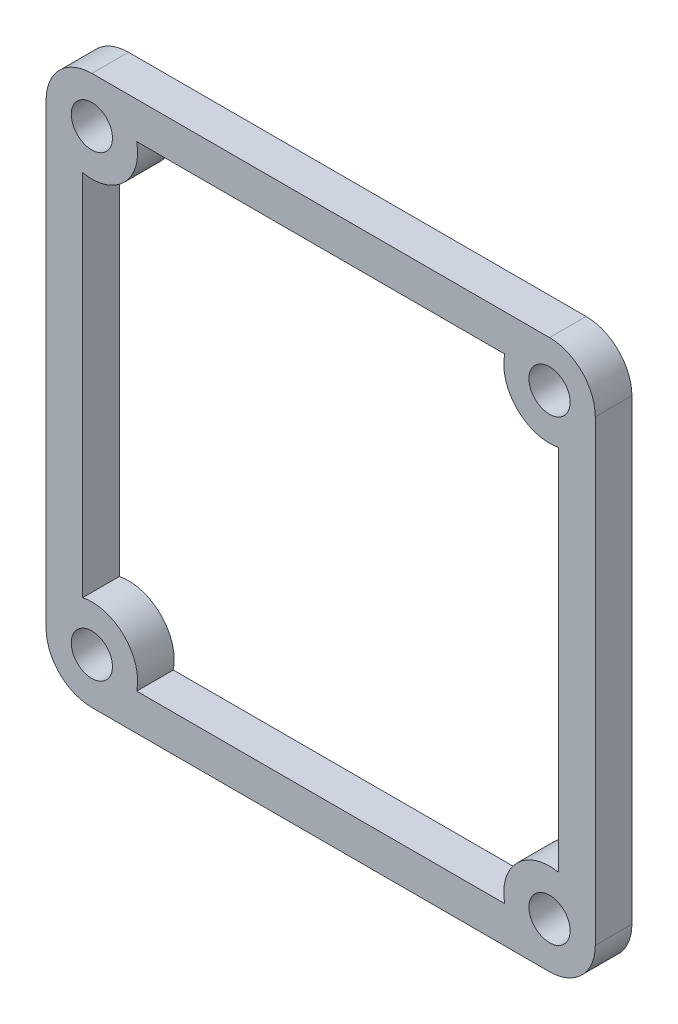
ISO-10303-21;
HEADER;
FILE_DESCRIPTION(('STEP AP214'),'2;1');
FILE_NAME('part.step','',(''),(''),'','','');
FILE_SCHEMA(('AUTOMOTIVE_DESIGN { 1 0 10303 214 1 1 1 1 }'));
ENDSEC;
DATA;
#1=APPLICATION_CONTEXT('core data for automotive mechanical design processes');
#2=APPLICATION_PROTOCOL_DEFINITION('international standard','automotive_design',2000,#1);
#3=PRODUCT_CONTEXT('',#1,'mechanical');
#4=PRODUCT('Part','Part','',(#3));
#5=PRODUCT_RELATED_PRODUCT_CATEGORY('part','',(#4));
#6=PRODUCT_DEFINITION_FORMATION('','',#4);
#7=PRODUCT_DEFINITION_CONTEXT('part definition',#1,'design');
#8=PRODUCT_DEFINITION('design','',#6,#7);
#9=PRODUCT_DEFINITION_SHAPE('','',#8);
#10=(LENGTH_UNIT() NAMED_UNIT(*) SI_UNIT(.MILLI.,.METRE.));
#11=(NAMED_UNIT(*) PLANE_ANGLE_UNIT() SI_UNIT($,.RADIAN.));
#12=(NAMED_UNIT(*) SI_UNIT($,.STERADIAN.) SOLID_ANGLE_UNIT());
#13=UNCERTAINTY_MEASURE_WITH_UNIT(LENGTH_MEASURE(1.E-05),#10,'distance_accuracy_value','');
#14=(GEOMETRIC_REPRESENTATION_CONTEXT(3) GLOBAL_UNCERTAINTY_ASSIGNED_CONTEXT((#13)) GLOBAL_UNIT_ASSIGNED_CONTEXT((#10,
#11,#12)) REPRESENTATION_CONTEXT('',''));
#15=CARTESIAN_POINT('',(0.,0.,0.));
#16=DIRECTION('',(0.,0.,1.));
#17=DIRECTION('',(1.,0.,0.));
#18=AXIS2_PLACEMENT_3D('',#15,#16,#17);
#19=CARTESIAN_POINT('',(0.,0.,4.));
#20=DIRECTION('',(0.,0.,1.));
#21=DIRECTION('',(1.,0.,0.));
#22=AXIS2_PLACEMENT_3D('',#19,#20,#21);
#23=PLANE('',#22);
#24=DIRECTION('',(1.,0.,0.));
#25=VECTOR('',#24,1.);
#26=CARTESIAN_POINT('',(0.,26.,4.));
#27=LINE('',#26,#25);
#28=CARTESIAN_POINT('',(-20.1010205144336,26.,4.));
#29=VERTEX_POINT('',#28);
#30=CARTESIAN_POINT('',(20.1010205144337,26.,4.));
#31=VERTEX_POINT('',#30);
#32=EDGE_CURVE('E379',#29,#31,#27,.T.);
#33=ORIENTED_EDGE('',*,*,#32,.T.);
#34=CARTESIAN_POINT('',(25.,25.,4.));
#35=DIRECTION('',(0.,0.,1.));
#36=DIRECTION('',(1.,0.,0.));
#37=AXIS2_PLACEMENT_3D('',#34,#35,#36);
#38=CIRCLE('',#37,4.99999999999999);
#39=CARTESIAN_POINT('',(26.,20.1010205144336,4.));
#40=VERTEX_POINT('',#39);
#41=EDGE_CURVE('E382',#31,#40,#38,.T.);
#42=ORIENTED_EDGE('',*,*,#41,.T.);
#43=DIRECTION('',(0.,-1.,0.));
#44=VECTOR('',#43,1.);
#45=CARTESIAN_POINT('',(26.,0.,4.));
#46=LINE('',#45,#44);
#47=CARTESIAN_POINT('',(26.,-20.1010205144337,4.));
#48=VERTEX_POINT('',#47);
#49=EDGE_CURVE('E360',#40,#48,#46,.T.);
#50=ORIENTED_EDGE('',*,*,#49,.T.);
#51=CARTESIAN_POINT('',(25.,-25.,4.));
#52=DIRECTION('',(0.,0.,1.));
#53=DIRECTION('',(1.,0.,0.));
#54=AXIS2_PLACEMENT_3D('',#51,#52,#53);
#55=CIRCLE('',#54,4.99999999999999);
#56=CARTESIAN_POINT('',(20.1010205144337,-26.,4.));
#57=VERTEX_POINT('',#56);
#58=EDGE_CURVE('E364',#48,#57,#55,.T.);
#59=ORIENTED_EDGE('',*,*,#58,.T.);
#60=DIRECTION('',(-1.,0.,0.));
#61=VECTOR('',#60,1.);
#62=CARTESIAN_POINT('',(0.,-26.,4.));
#63=LINE('',#62,#61);
#64=CARTESIAN_POINT('',(-20.1010205144336,-26.,4.));
#65=VERTEX_POINT('',#64);
#66=EDGE_CURVE('E367',#57,#65,#63,.T.);
#67=ORIENTED_EDGE('',*,*,#66,.T.);
#68=CARTESIAN_POINT('',(-25.,-25.,4.));
#69=DIRECTION('',(0.,0.,1.));
#70=DIRECTION('',(1.,0.,0.));
#71=AXIS2_PLACEMENT_3D('',#68,#69,#70);
#72=CIRCLE('',#71,4.99999999999999);
#73=CARTESIAN_POINT('',(-26.,-20.1010205144336,4.));
#74=VERTEX_POINT('',#73);
#75=EDGE_CURVE('E370',#65,#74,#72,.T.);
#76=ORIENTED_EDGE('',*,*,#75,.T.);
#77=DIRECTION('',(0.,-1.,0.));
#78=VECTOR('',#77,1.);
#79=CARTESIAN_POINT('',(-26.,0.,4.));
#80=LINE('',#79,#78);
#81=CARTESIAN_POINT('',(-26.,20.1010205144337,4.));
#82=VERTEX_POINT('',#81);
#83=EDGE_CURVE('E373',#82,#74,#80,.T.);
#84=ORIENTED_EDGE('',*,*,#83,.F.);
#85=CARTESIAN_POINT('',(-25.,25.,4.));
#86=DIRECTION('',(0.,0.,1.));
#87=DIRECTION('',(1.,0.,0.));
#88=AXIS2_PLACEMENT_3D('',#85,#86,#87);
#89=CIRCLE('',#88,4.99999999999999);
#90=EDGE_CURVE('E376',#82,#29,#89,.T.);
#91=ORIENTED_EDGE('',*,*,#90,.T.);
#92=EDGE_LOOP('',(#33,#42,#50,#59,#67,#76,#84,#91));
#93=FACE_BOUND('',#92,.T.);
#94=CARTESIAN_POINT('',(-25.,25.,4.));
#95=DIRECTION('',(0.,0.,1.));
#96=DIRECTION('',(1.,0.,0.));
#97=AXIS2_PLACEMENT_3D('',#94,#95,#96);
#98=CIRCLE('',#97,2.25);
#99=CARTESIAN_POINT('',(-22.75,25.,4.));
#100=VERTEX_POINT('',#99);
#101=EDGE_CURVE('E309',#100,#100,#98,.T.);
#102=ORIENTED_EDGE('',*,*,#101,.F.);
#103=EDGE_LOOP('',(#102));
#104=FACE_BOUND('',#103,.T.);
#105=CARTESIAN_POINT('',(25.,25.,4.));
#106=DIRECTION('',(0.,0.,1.));
#107=DIRECTION('',(1.,0.,0.));
#108=AXIS2_PLACEMENT_3D('',#105,#106,#107);
#109=CIRCLE('',#108,2.25);
#110=CARTESIAN_POINT('',(27.25,25.,4.));
#111=VERTEX_POINT('',#110);
#112=EDGE_CURVE('E315',#111,#111,#109,.T.);
#113=ORIENTED_EDGE('',*,*,#112,.F.);
#114=EDGE_LOOP('',(#113));
#115=FACE_BOUND('',#114,.T.);
#116=CARTESIAN_POINT('',(25.,-25.,4.));
#117=DIRECTION('',(0.,0.,1.));
#118=DIRECTION('',(1.,0.,0.));
#119=AXIS2_PLACEMENT_3D('',#116,#117,#118);
#120=CIRCLE('',#119,2.25);
#121=CARTESIAN_POINT('',(27.25,-25.,4.));
#122=VERTEX_POINT('',#121);
#123=EDGE_CURVE('E321',#122,#122,#120,.T.);
#124=ORIENTED_EDGE('',*,*,#123,.F.);
#125=EDGE_LOOP('',(#124));
#126=FACE_BOUND('',#125,.T.);
#127=CARTESIAN_POINT('',(-25.,-25.,4.));
#128=DIRECTION('',(0.,0.,1.));
#129=DIRECTION('',(1.,0.,0.));
#130=AXIS2_PLACEMENT_3D('',#127,#128,#129);
#131=CIRCLE('',#130,2.25);
#132=CARTESIAN_POINT('',(-22.75,-25.,4.));
#133=VERTEX_POINT('',#132);
#134=EDGE_CURVE('E327',#133,#133,#131,.T.);
#135=ORIENTED_EDGE('',*,*,#134,.F.);
#136=EDGE_LOOP('',(#135));
#137=FACE_BOUND('',#136,.T.);
#138=DIRECTION('',(0.,-1.,0.));
#139=VECTOR('',#138,1.);
#140=CARTESIAN_POINT('',(-30.,30.,4.));
#141=LINE('',#140,#139);
#142=CARTESIAN_POINT('',(-30.,25.,4.));
#143=VERTEX_POINT('',#142);
#144=CARTESIAN_POINT('',(-30.,-25.,4.));
#145=VERTEX_POINT('',#144);
#146=EDGE_CURVE('E174',#143,#145,#141,.T.);
#147=ORIENTED_EDGE('',*,*,#146,.T.);
#148=CARTESIAN_POINT('',(-25.,-25.,4.));
#149=DIRECTION('',(0.,0.,1.));
#150=DIRECTION('',(1.,0.,0.));
#151=AXIS2_PLACEMENT_3D('',#148,#149,#150);
#152=CIRCLE('',#151,4.99999999999999);
#153=CARTESIAN_POINT('',(-25.,-30.,4.));
#154=VERTEX_POINT('',#153);
#155=EDGE_CURVE('E280',#145,#154,#152,.T.);
#156=ORIENTED_EDGE('',*,*,#155,.T.);
#157=DIRECTION('',(1.,0.,0.));
#158=VECTOR('',#157,1.);
#159=CARTESIAN_POINT('',(-30.,-30.,4.));
#160=LINE('',#159,#158);
#161=CARTESIAN_POINT('',(25.,-30.,4.));
#162=VERTEX_POINT('',#161);
#163=EDGE_CURVE('E12',#154,#162,#160,.T.);
#164=ORIENTED_EDGE('',*,*,#163,.T.);
#165=CARTESIAN_POINT('',(25.,-25.,4.));
#166=DIRECTION('',(0.,0.,1.));
#167=DIRECTION('',(1.,0.,0.));
#168=AXIS2_PLACEMENT_3D('',#165,#166,#167);
#169=CIRCLE('',#168,5.);
#170=CARTESIAN_POINT('',(30.,-25.,4.));
#171=VERTEX_POINT('',#170);
#172=EDGE_CURVE('E417',#162,#171,#169,.T.);
#173=ORIENTED_EDGE('',*,*,#172,.T.);
#174=DIRECTION('',(0.,1.,0.));
#175=VECTOR('',#174,1.);
#176=CARTESIAN_POINT('',(30.,30.,4.));
#177=LINE('',#176,#175);
#178=CARTESIAN_POINT('',(30.,25.,4.));
#179=VERTEX_POINT('',#178);
#180=EDGE_CURVE('E299',#171,#179,#177,.T.);
#181=ORIENTED_EDGE('',*,*,#180,.T.);
#182=CARTESIAN_POINT('',(25.,25.,4.));
#183=DIRECTION('',(0.,0.,1.));
#184=DIRECTION('',(1.,0.,0.));
#185=AXIS2_PLACEMENT_3D('',#182,#183,#184);
#186=CIRCLE('',#185,5.);
#187=CARTESIAN_POINT('',(25.,30.,4.));
#188=VERTEX_POINT('',#187);
#189=EDGE_CURVE('E407',#179,#188,#186,.T.);
#190=ORIENTED_EDGE('',*,*,#189,.T.);
#191=DIRECTION('',(-1.,0.,0.));
#192=VECTOR('',#191,1.);
#193=CARTESIAN_POINT('',(-30.,30.,4.));
#194=LINE('',#193,#192);
#195=CARTESIAN_POINT('',(-25.,30.,4.));
#196=VERTEX_POINT('',#195);
#197=EDGE_CURVE('E306',#188,#196,#194,.T.);
#198=ORIENTED_EDGE('',*,*,#197,.T.);
#199=CARTESIAN_POINT('',(-25.,25.,4.));
#200=DIRECTION('',(0.,0.,1.));
#201=DIRECTION('',(1.,0.,0.));
#202=AXIS2_PLACEMENT_3D('',#199,#200,#201);
#203=CIRCLE('',#202,4.99999999999999);
#204=EDGE_CURVE('E337',#196,#143,#203,.T.);
#205=ORIENTED_EDGE('',*,*,#204,.T.);
#206=EDGE_LOOP('',(#147,#156,#164,#173,#181,#190,#198,#205));
#207=FACE_BOUND('',#206,.T.);
#208=ADVANCED_FACE('F165',(#93,#104,#115,#126,#137,#207),#23,.T.);
#209=CARTESIAN_POINT('',(0.,0.,0.));
#210=DIRECTION('',(0.,0.,1.));
#211=DIRECTION('',(1.,0.,0.));
#212=AXIS2_PLACEMENT_3D('',#209,#210,#211);
#213=PLANE('',#212);
#214=CARTESIAN_POINT('',(25.,25.,0.));
#215=DIRECTION('',(0.,0.,1.));
#216=DIRECTION('',(1.,0.,0.));
#217=AXIS2_PLACEMENT_3D('',#214,#215,#216);
#218=CIRCLE('',#217,4.99999999999999);
#219=CARTESIAN_POINT('',(20.1010205144337,26.,0.));
#220=VERTEX_POINT('',#219);
#221=CARTESIAN_POINT('',(26.,20.1010205144336,0.));
#222=VERTEX_POINT('',#221);
#223=EDGE_CURVE('E363',#220,#222,#218,.T.);
#224=ORIENTED_EDGE('',*,*,#223,.F.);
#225=DIRECTION('',(1.,0.,0.));
#226=VECTOR('',#225,1.);
#227=CARTESIAN_POINT('',(0.,26.,0.));
#228=LINE('',#227,#226);
#229=CARTESIAN_POINT('',(-20.1010205144336,26.,0.));
#230=VERTEX_POINT('',#229);
#231=EDGE_CURVE('E399',#230,#220,#228,.T.);
#232=ORIENTED_EDGE('',*,*,#231,.F.);
#233=CARTESIAN_POINT('',(-25.,25.,0.));
#234=DIRECTION('',(0.,0.,1.));
#235=DIRECTION('',(1.,0.,0.));
#236=AXIS2_PLACEMENT_3D('',#233,#234,#235);
#237=CIRCLE('',#236,4.99999999999999);
#238=CARTESIAN_POINT('',(-26.,20.1010205144337,0.));
#239=VERTEX_POINT('',#238);
#240=EDGE_CURVE('E396',#239,#230,#237,.T.);
#241=ORIENTED_EDGE('',*,*,#240,.F.);
#242=DIRECTION('',(0.,-1.,0.));
#243=VECTOR('',#242,1.);
#244=CARTESIAN_POINT('',(-26.,0.,0.));
#245=LINE('',#244,#243);
#246=CARTESIAN_POINT('',(-26.,-20.1010205144336,0.));
#247=VERTEX_POINT('',#246);
#248=EDGE_CURVE('E393',#239,#247,#245,.T.);
#249=ORIENTED_EDGE('',*,*,#248,.T.);
#250=CARTESIAN_POINT('',(-25.,-25.,0.));
#251=DIRECTION('',(0.,0.,1.));
#252=DIRECTION('',(1.,0.,0.));
#253=AXIS2_PLACEMENT_3D('',#250,#251,#252);
#254=CIRCLE('',#253,4.99999999999999);
#255=CARTESIAN_POINT('',(-20.1010205144336,-26.,0.));
#256=VERTEX_POINT('',#255);
#257=EDGE_CURVE('E391',#256,#247,#254,.T.);
#258=ORIENTED_EDGE('',*,*,#257,.F.);
#259=DIRECTION('',(-1.,0.,0.));
#260=VECTOR('',#259,1.);
#261=CARTESIAN_POINT('',(0.,-26.,0.));
#262=LINE('',#261,#260);
#263=CARTESIAN_POINT('',(20.1010205144337,-26.,0.));
#264=VERTEX_POINT('',#263);
#265=EDGE_CURVE('E389',#264,#256,#262,.T.);
#266=ORIENTED_EDGE('',*,*,#265,.F.);
#267=CARTESIAN_POINT('',(25.,-25.,0.));
#268=DIRECTION('',(0.,0.,1.));
#269=DIRECTION('',(1.,0.,0.));
#270=AXIS2_PLACEMENT_3D('',#267,#268,#269);
#271=CIRCLE('',#270,4.99999999999999);
#272=CARTESIAN_POINT('',(26.,-20.1010205144337,0.));
#273=VERTEX_POINT('',#272);
#274=EDGE_CURVE('E387',#273,#264,#271,.T.);
#275=ORIENTED_EDGE('',*,*,#274,.F.);
#276=DIRECTION('',(0.,-1.,0.));
#277=VECTOR('',#276,1.);
#278=CARTESIAN_POINT('',(26.,0.,0.));
#279=LINE('',#278,#277);
#280=EDGE_CURVE('E346',#222,#273,#279,.T.);
#281=ORIENTED_EDGE('',*,*,#280,.F.);
#282=EDGE_LOOP('',(#224,#232,#241,#249,#258,#266,#275,#281));
#283=FACE_BOUND('',#282,.T.);
#284=CARTESIAN_POINT('',(-25.,25.,0.));
#285=DIRECTION('',(0.,0.,1.));
#286=DIRECTION('',(1.,0.,0.));
#287=AXIS2_PLACEMENT_3D('',#284,#285,#286);
#288=CIRCLE('',#287,2.25);
#289=CARTESIAN_POINT('',(-22.75,25.,0.));
#290=VERTEX_POINT('',#289);
#291=EDGE_CURVE('E303',#290,#290,#288,.T.);
#292=ORIENTED_EDGE('',*,*,#291,.T.);
#293=EDGE_LOOP('',(#292));
#294=FACE_BOUND('',#293,.T.);
#295=CARTESIAN_POINT('',(25.,25.,0.));
#296=DIRECTION('',(0.,0.,1.));
#297=DIRECTION('',(1.,0.,0.));
#298=AXIS2_PLACEMENT_3D('',#295,#296,#297);
#299=CIRCLE('',#298,2.25);
#300=CARTESIAN_POINT('',(27.25,25.,0.));
#301=VERTEX_POINT('',#300);
#302=EDGE_CURVE('E312',#301,#301,#299,.T.);
#303=ORIENTED_EDGE('',*,*,#302,.T.);
#304=EDGE_LOOP('',(#303));
#305=FACE_BOUND('',#304,.T.);
#306=CARTESIAN_POINT('',(25.,-25.,0.));
#307=DIRECTION('',(0.,0.,1.));
#308=DIRECTION('',(1.,0.,0.));
#309=AXIS2_PLACEMENT_3D('',#306,#307,#308);
#310=CIRCLE('',#309,2.25);
#311=CARTESIAN_POINT('',(27.25,-25.,0.));
#312=VERTEX_POINT('',#311);
#313=EDGE_CURVE('E318',#312,#312,#310,.T.);
#314=ORIENTED_EDGE('',*,*,#313,.T.);
#315=EDGE_LOOP('',(#314));
#316=FACE_BOUND('',#315,.T.);
#317=CARTESIAN_POINT('',(-25.,-25.,0.));
#318=DIRECTION('',(0.,0.,1.));
#319=DIRECTION('',(1.,0.,0.));
#320=AXIS2_PLACEMENT_3D('',#317,#318,#319);
#321=CIRCLE('',#320,2.25);
#322=CARTESIAN_POINT('',(-22.75,-25.,0.));
#323=VERTEX_POINT('',#322);
#324=EDGE_CURVE('E324',#323,#323,#321,.T.);
#325=ORIENTED_EDGE('',*,*,#324,.T.);
#326=EDGE_LOOP('',(#325));
#327=FACE_BOUND('',#326,.T.);
#328=CARTESIAN_POINT('',(-25.,-25.,0.));
#329=DIRECTION('',(0.,0.,1.));
#330=DIRECTION('',(1.,0.,0.));
#331=AXIS2_PLACEMENT_3D('',#328,#329,#330);
#332=CIRCLE('',#331,4.99999999999999);
#333=CARTESIAN_POINT('',(-30.,-25.,0.));
#334=VERTEX_POINT('',#333);
#335=CARTESIAN_POINT('',(-25.,-30.,0.));
#336=VERTEX_POINT('',#335);
#337=EDGE_CURVE('E182',#334,#336,#332,.T.);
#338=ORIENTED_EDGE('',*,*,#337,.F.);
#339=DIRECTION('',(0.,-1.,0.));
#340=VECTOR('',#339,1.);
#341=CARTESIAN_POINT('',(-30.,30.,0.));
#342=LINE('',#341,#340);
#343=CARTESIAN_POINT('',(-30.,25.,0.));
#344=VERTEX_POINT('',#343);
#345=EDGE_CURVE('E292',#344,#334,#342,.T.);
#346=ORIENTED_EDGE('',*,*,#345,.F.);
#347=CARTESIAN_POINT('',(-25.,25.,0.));
#348=DIRECTION('',(0.,0.,1.));
#349=DIRECTION('',(1.,0.,0.));
#350=AXIS2_PLACEMENT_3D('',#347,#348,#349);
#351=CIRCLE('',#350,4.99999999999999);
#352=CARTESIAN_POINT('',(-25.,30.,0.));
#353=VERTEX_POINT('',#352);
#354=EDGE_CURVE('E335',#353,#344,#351,.T.);
#355=ORIENTED_EDGE('',*,*,#354,.F.);
#356=DIRECTION('',(-1.,0.,0.));
#357=VECTOR('',#356,1.);
#358=CARTESIAN_POINT('',(-30.,30.,0.));
#359=LINE('',#358,#357);
#360=CARTESIAN_POINT('',(25.,30.,0.));
#361=VERTEX_POINT('',#360);
#362=EDGE_CURVE('E298',#361,#353,#359,.T.);
#363=ORIENTED_EDGE('',*,*,#362,.F.);
#364=CARTESIAN_POINT('',(25.,25.,0.));
#365=DIRECTION('',(0.,0.,1.));
#366=DIRECTION('',(1.,0.,0.));
#367=AXIS2_PLACEMENT_3D('',#364,#365,#366);
#368=CIRCLE('',#367,5.);
#369=CARTESIAN_POINT('',(30.,25.,0.));
#370=VERTEX_POINT('',#369);
#371=EDGE_CURVE('E405',#370,#361,#368,.T.);
#372=ORIENTED_EDGE('',*,*,#371,.F.);
#373=DIRECTION('',(0.,1.,0.));
#374=VECTOR('',#373,1.);
#375=CARTESIAN_POINT('',(30.,30.,0.));
#376=LINE('',#375,#374);
#377=CARTESIAN_POINT('',(30.,-25.,0.));
#378=VERTEX_POINT('',#377);
#379=EDGE_CURVE('E300',#378,#370,#376,.T.);
#380=ORIENTED_EDGE('',*,*,#379,.F.);
#381=CARTESIAN_POINT('',(25.,-25.,0.));
#382=DIRECTION('',(0.,0.,1.));
#383=DIRECTION('',(1.,0.,0.));
#384=AXIS2_PLACEMENT_3D('',#381,#382,#383);
#385=CIRCLE('',#384,5.);
#386=CARTESIAN_POINT('',(25.,-30.,0.));
#387=VERTEX_POINT('',#386);
#388=EDGE_CURVE('E415',#387,#378,#385,.T.);
#389=ORIENTED_EDGE('',*,*,#388,.F.);
#390=DIRECTION('',(1.,0.,0.));
#391=VECTOR('',#390,1.);
#392=CARTESIAN_POINT('',(-30.,-30.,0.));
#393=LINE('',#392,#391);
#394=EDGE_CURVE('E169',#336,#387,#393,.T.);
#395=ORIENTED_EDGE('',*,*,#394,.F.);
#396=EDGE_LOOP('',(#338,#346,#355,#363,#372,#380,#389,#395));
#397=FACE_BOUND('',#396,.T.);
#398=ADVANCED_FACE('F290',(#283,#294,#305,#316,#327,#397),#213,.F.);
#399=CARTESIAN_POINT('',(-30.,-30.,4.));
#400=DIRECTION('',(0.,1.,0.));
#401=DIRECTION('',(0.,0.,1.));
#402=AXIS2_PLACEMENT_3D('',#399,#400,#401);
#403=PLANE('',#402);
#404=DIRECTION('',(0.,0.,1.));
#405=VECTOR('',#404,1.);
#406=CARTESIAN_POINT('',(-25.,-30.,0.));
#407=LINE('',#406,#405);
#408=EDGE_CURVE('E285',#336,#154,#407,.T.);
#409=ORIENTED_EDGE('',*,*,#408,.F.);
#410=ORIENTED_EDGE('',*,*,#394,.T.);
#411=DIRECTION('',(0.,0.,1.));
#412=VECTOR('',#411,1.);
#413=CARTESIAN_POINT('',(25.,-30.,0.));
#414=LINE('',#413,#412);
#415=EDGE_CURVE('E412',#387,#162,#414,.T.);
#416=ORIENTED_EDGE('',*,*,#415,.T.);
#417=ORIENTED_EDGE('',*,*,#163,.F.);
#418=EDGE_LOOP('',(#409,#410,#416,#417));
#419=FACE_BOUND('',#418,.T.);
#420=ADVANCED_FACE('F422',(#419),#403,.F.);
#421=CARTESIAN_POINT('',(30.,30.,4.));
#422=DIRECTION('',(-1.,0.,0.));
#423=DIRECTION('',(0.,-1.,0.));
#424=AXIS2_PLACEMENT_3D('',#421,#422,#423);
#425=PLANE('',#424);
#426=DIRECTION('',(0.,0.,1.));
#427=VECTOR('',#426,1.);
#428=CARTESIAN_POINT('',(30.,-25.,0.));
#429=LINE('',#428,#427);
#430=EDGE_CURVE('E410',#378,#171,#429,.T.);
#431=ORIENTED_EDGE('',*,*,#430,.F.);
#432=ORIENTED_EDGE('',*,*,#379,.T.);
#433=DIRECTION('',(0.,0.,1.));
#434=VECTOR('',#433,1.);
#435=CARTESIAN_POINT('',(30.,25.,0.));
#436=LINE('',#435,#434);
#437=EDGE_CURVE('E402',#370,#179,#436,.T.);
#438=ORIENTED_EDGE('',*,*,#437,.T.);
#439=ORIENTED_EDGE('',*,*,#180,.F.);
#440=EDGE_LOOP('',(#431,#432,#438,#439));
#441=FACE_BOUND('',#440,.T.);
#442=ADVANCED_FACE('F167',(#441),#425,.F.);
#443=CARTESIAN_POINT('',(-30.,30.,4.));
#444=DIRECTION('',(0.,-1.,0.));
#445=DIRECTION('',(0.,0.,-1.));
#446=AXIS2_PLACEMENT_3D('',#443,#444,#445);
#447=PLANE('',#446);
#448=DIRECTION('',(0.,0.,1.));
#449=VECTOR('',#448,1.);
#450=CARTESIAN_POINT('',(25.,30.,0.));
#451=LINE('',#450,#449);
#452=EDGE_CURVE('E385',#361,#188,#451,.T.);
#453=ORIENTED_EDGE('',*,*,#452,.F.);
#454=ORIENTED_EDGE('',*,*,#362,.T.);
#455=DIRECTION('',(0.,0.,1.));
#456=VECTOR('',#455,1.);
#457=CARTESIAN_POINT('',(-25.,30.,0.));
#458=LINE('',#457,#456);
#459=EDGE_CURVE('E332',#353,#196,#458,.T.);
#460=ORIENTED_EDGE('',*,*,#459,.T.);
#461=ORIENTED_EDGE('',*,*,#197,.F.);
#462=EDGE_LOOP('',(#453,#454,#460,#461));
#463=FACE_BOUND('',#462,.T.);
#464=ADVANCED_FACE('F440',(#463),#447,.F.);
#465=CARTESIAN_POINT('',(-30.,30.,4.));
#466=DIRECTION('',(1.,0.,0.));
#467=DIRECTION('',(0.,1.,0.));
#468=AXIS2_PLACEMENT_3D('',#465,#466,#467);
#469=PLANE('',#468);
#470=ORIENTED_EDGE('',*,*,#345,.T.);
#471=DIRECTION('',(0.,0.,1.));
#472=VECTOR('',#471,1.);
#473=CARTESIAN_POINT('',(-30.,-25.,0.));
#474=LINE('',#473,#472);
#475=EDGE_CURVE('E278',#334,#145,#474,.T.);
#476=ORIENTED_EDGE('',*,*,#475,.T.);
#477=ORIENTED_EDGE('',*,*,#146,.F.);
#478=DIRECTION('',(0.,0.,1.));
#479=VECTOR('',#478,1.);
#480=CARTESIAN_POINT('',(-30.,25.,0.));
#481=LINE('',#480,#479);
#482=EDGE_CURVE('E297',#344,#143,#481,.T.);
#483=ORIENTED_EDGE('',*,*,#482,.F.);
#484=EDGE_LOOP('',(#470,#476,#477,#483));
#485=FACE_BOUND('',#484,.T.);
#486=ADVANCED_FACE('F296',(#485),#469,.F.);
#487=CARTESIAN_POINT('',(-25.,25.,0.));
#488=DIRECTION('',(0.,0.,1.));
#489=DIRECTION('',(1.,0.,0.));
#490=AXIS2_PLACEMENT_3D('',#487,#488,#489);
#491=CYLINDRICAL_SURFACE('',#490,2.25);
#492=ORIENTED_EDGE('',*,*,#291,.F.);
#493=EDGE_LOOP('',(#492));
#494=FACE_BOUND('',#493,.T.);
#495=ORIENTED_EDGE('',*,*,#101,.T.);
#496=EDGE_LOOP('',(#495));
#497=FACE_BOUND('',#496,.T.);
#498=ADVANCED_FACE('F468',(#494,#497),#491,.F.);
#499=CARTESIAN_POINT('',(25.,25.,0.));
#500=DIRECTION('',(0.,0.,1.));
#501=DIRECTION('',(1.,0.,0.));
#502=AXIS2_PLACEMENT_3D('',#499,#500,#501);
#503=CYLINDRICAL_SURFACE('',#502,2.25);
#504=ORIENTED_EDGE('',*,*,#302,.F.);
#505=EDGE_LOOP('',(#504));
#506=FACE_BOUND('',#505,.T.);
#507=ORIENTED_EDGE('',*,*,#112,.T.);
#508=EDGE_LOOP('',(#507));
#509=FACE_BOUND('',#508,.T.);
#510=ADVANCED_FACE('F509',(#506,#509),#503,.F.);
#511=CARTESIAN_POINT('',(25.,-25.,0.));
#512=DIRECTION('',(0.,0.,1.));
#513=DIRECTION('',(1.,0.,0.));
#514=AXIS2_PLACEMENT_3D('',#511,#512,#513);
#515=CYLINDRICAL_SURFACE('',#514,2.25);
#516=ORIENTED_EDGE('',*,*,#313,.F.);
#517=EDGE_LOOP('',(#516));
#518=FACE_BOUND('',#517,.T.);
#519=ORIENTED_EDGE('',*,*,#123,.T.);
#520=EDGE_LOOP('',(#519));
#521=FACE_BOUND('',#520,.T.);
#522=ADVANCED_FACE('F455',(#518,#521),#515,.F.);
#523=CARTESIAN_POINT('',(-25.,-25.,0.));
#524=DIRECTION('',(0.,0.,1.));
#525=DIRECTION('',(1.,0.,0.));
#526=AXIS2_PLACEMENT_3D('',#523,#524,#525);
#527=CYLINDRICAL_SURFACE('',#526,2.25);
#528=ORIENTED_EDGE('',*,*,#324,.F.);
#529=EDGE_LOOP('',(#528));
#530=FACE_BOUND('',#529,.T.);
#531=ORIENTED_EDGE('',*,*,#134,.T.);
#532=EDGE_LOOP('',(#531));
#533=FACE_BOUND('',#532,.T.);
#534=ADVANCED_FACE('F446',(#530,#533),#527,.F.);
#535=CARTESIAN_POINT('',(-25.,25.,0.));
#536=DIRECTION('',(0.,0.,1.));
#537=DIRECTION('',(1.,0.,0.));
#538=AXIS2_PLACEMENT_3D('',#535,#536,#537);
#539=CYLINDRICAL_SURFACE('',#538,4.99999999999999);
#540=ORIENTED_EDGE('',*,*,#204,.F.);
#541=ORIENTED_EDGE('',*,*,#459,.F.);
#542=ORIENTED_EDGE('',*,*,#354,.T.);
#543=ORIENTED_EDGE('',*,*,#482,.T.);
#544=EDGE_LOOP('',(#540,#541,#542,#543));
#545=FACE_BOUND('',#544,.T.);
#546=ADVANCED_FACE('F443',(#545),#539,.T.);
#547=CARTESIAN_POINT('',(25.,25.,0.));
#548=DIRECTION('',(0.,0.,1.));
#549=DIRECTION('',(1.,0.,0.));
#550=AXIS2_PLACEMENT_3D('',#547,#548,#549);
#551=CYLINDRICAL_SURFACE('',#550,4.99999999999999);
#552=ORIENTED_EDGE('',*,*,#41,.F.);
#553=DIRECTION('',(0.,0.,1.));
#554=VECTOR('',#553,1.);
#555=CARTESIAN_POINT('',(20.1010205144337,26.,0.));
#556=LINE('',#555,#554);
#557=EDGE_CURVE('E342',#220,#31,#556,.T.);
#558=ORIENTED_EDGE('',*,*,#557,.F.);
#559=ORIENTED_EDGE('',*,*,#223,.T.);
#560=DIRECTION('',(0.,0.,1.));
#561=VECTOR('',#560,1.);
#562=CARTESIAN_POINT('',(26.,20.1010205144336,0.));
#563=LINE('',#562,#561);
#564=EDGE_CURVE('E340',#222,#40,#563,.T.);
#565=ORIENTED_EDGE('',*,*,#564,.T.);
#566=EDGE_LOOP('',(#552,#558,#559,#565));
#567=FACE_BOUND('',#566,.T.);
#568=ADVANCED_FACE('F445',(#567),#551,.T.);
#569=CARTESIAN_POINT('',(26.,0.,0.));
#570=DIRECTION('',(-1.,0.,0.));
#571=DIRECTION('',(0.,-1.,0.));
#572=AXIS2_PLACEMENT_3D('',#569,#570,#571);
#573=PLANE('',#572);
#574=ORIENTED_EDGE('',*,*,#49,.F.);
#575=ORIENTED_EDGE('',*,*,#564,.F.);
#576=ORIENTED_EDGE('',*,*,#280,.T.);
#577=DIRECTION('',(0.,0.,1.));
#578=VECTOR('',#577,1.);
#579=CARTESIAN_POINT('',(26.,-20.1010205144337,0.));
#580=LINE('',#579,#578);
#581=EDGE_CURVE('E356',#273,#48,#580,.T.);
#582=ORIENTED_EDGE('',*,*,#581,.T.);
#583=EDGE_LOOP('',(#574,#575,#576,#582));
#584=FACE_BOUND('',#583,.T.);
#585=ADVANCED_FACE('F452',(#584),#573,.T.);
#586=CARTESIAN_POINT('',(25.,-25.,0.));
#587=DIRECTION('',(0.,0.,1.));
#588=DIRECTION('',(1.,0.,0.));
#589=AXIS2_PLACEMENT_3D('',#586,#587,#588);
#590=CYLINDRICAL_SURFACE('',#589,4.99999999999999);
#591=ORIENTED_EDGE('',*,*,#58,.F.);
#592=ORIENTED_EDGE('',*,*,#581,.F.);
#593=ORIENTED_EDGE('',*,*,#274,.T.);
#594=DIRECTION('',(0.,0.,1.));
#595=VECTOR('',#594,1.);
#596=CARTESIAN_POINT('',(20.1010205144337,-26.,0.));
#597=LINE('',#596,#595);
#598=EDGE_CURVE('E354',#264,#57,#597,.T.);
#599=ORIENTED_EDGE('',*,*,#598,.T.);
#600=EDGE_LOOP('',(#591,#592,#593,#599));
#601=FACE_BOUND('',#600,.T.);
#602=ADVANCED_FACE('F551',(#601),#590,.T.);
#603=CARTESIAN_POINT('',(0.,-26.,0.));
#604=DIRECTION('',(0.,1.,0.));
#605=DIRECTION('',(-1.,0.,0.));
#606=AXIS2_PLACEMENT_3D('',#603,#604,#605);
#607=PLANE('',#606);
#608=ORIENTED_EDGE('',*,*,#66,.F.);
#609=ORIENTED_EDGE('',*,*,#598,.F.);
#610=ORIENTED_EDGE('',*,*,#265,.T.);
#611=DIRECTION('',(0.,0.,1.));
#612=VECTOR('',#611,1.);
#613=CARTESIAN_POINT('',(-20.1010205144336,-26.,0.));
#614=LINE('',#613,#612);
#615=EDGE_CURVE('E352',#256,#65,#614,.T.);
#616=ORIENTED_EDGE('',*,*,#615,.T.);
#617=EDGE_LOOP('',(#608,#609,#610,#616));
#618=FACE_BOUND('',#617,.T.);
#619=ADVANCED_FACE('F561',(#618),#607,.T.);
#620=CARTESIAN_POINT('',(-25.,-25.,0.));
#621=DIRECTION('',(0.,0.,1.));
#622=DIRECTION('',(1.,0.,0.));
#623=AXIS2_PLACEMENT_3D('',#620,#621,#622);
#624=CYLINDRICAL_SURFACE('',#623,4.99999999999999);
#625=ORIENTED_EDGE('',*,*,#75,.F.);
#626=ORIENTED_EDGE('',*,*,#615,.F.);
#627=ORIENTED_EDGE('',*,*,#257,.T.);
#628=DIRECTION('',(0.,0.,1.));
#629=VECTOR('',#628,1.);
#630=CARTESIAN_POINT('',(-26.,-20.1010205144336,0.));
#631=LINE('',#630,#629);
#632=EDGE_CURVE('E350',#247,#74,#631,.T.);
#633=ORIENTED_EDGE('',*,*,#632,.T.);
#634=EDGE_LOOP('',(#625,#626,#627,#633));
#635=FACE_BOUND('',#634,.T.);
#636=ADVANCED_FACE('F571',(#635),#624,.T.);
#637=CARTESIAN_POINT('',(-26.,0.,0.));
#638=DIRECTION('',(-1.,0.,0.));
#639=DIRECTION('',(0.,-1.,0.));
#640=AXIS2_PLACEMENT_3D('',#637,#638,#639);
#641=PLANE('',#640);
#642=ORIENTED_EDGE('',*,*,#83,.T.);
#643=ORIENTED_EDGE('',*,*,#632,.F.);
#644=ORIENTED_EDGE('',*,*,#248,.F.);
#645=DIRECTION('',(0.,0.,1.));
#646=VECTOR('',#645,1.);
#647=CARTESIAN_POINT('',(-26.,20.1010205144337,0.));
#648=LINE('',#647,#646);
#649=EDGE_CURVE('E348',#239,#82,#648,.T.);
#650=ORIENTED_EDGE('',*,*,#649,.T.);
#651=EDGE_LOOP('',(#642,#643,#644,#650));
#652=FACE_BOUND('',#651,.T.);
#653=ADVANCED_FACE('F581',(#652),#641,.F.);
#654=CARTESIAN_POINT('',(-25.,25.,0.));
#655=DIRECTION('',(0.,0.,1.));
#656=DIRECTION('',(1.,0.,0.));
#657=AXIS2_PLACEMENT_3D('',#654,#655,#656);
#658=CYLINDRICAL_SURFACE('',#657,4.99999999999999);
#659=ORIENTED_EDGE('',*,*,#90,.F.);
#660=ORIENTED_EDGE('',*,*,#649,.F.);
#661=ORIENTED_EDGE('',*,*,#240,.T.);
#662=DIRECTION('',(0.,0.,1.));
#663=VECTOR('',#662,1.);
#664=CARTESIAN_POINT('',(-20.1010205144336,26.,0.));
#665=LINE('',#664,#663);
#666=EDGE_CURVE('E345',#230,#29,#665,.T.);
#667=ORIENTED_EDGE('',*,*,#666,.T.);
#668=EDGE_LOOP('',(#659,#660,#661,#667));
#669=FACE_BOUND('',#668,.T.);
#670=ADVANCED_FACE('F591',(#669),#658,.T.);
#671=CARTESIAN_POINT('',(0.,26.,0.));
#672=DIRECTION('',(0.,-1.,0.));
#673=DIRECTION('',(0.,0.,-1.));
#674=AXIS2_PLACEMENT_3D('',#671,#672,#673);
#675=PLANE('',#674);
#676=ORIENTED_EDGE('',*,*,#32,.F.);
#677=ORIENTED_EDGE('',*,*,#666,.F.);
#678=ORIENTED_EDGE('',*,*,#231,.T.);
#679=ORIENTED_EDGE('',*,*,#557,.T.);
#680=EDGE_LOOP('',(#676,#677,#678,#679));
#681=FACE_BOUND('',#680,.T.);
#682=ADVANCED_FACE('F601',(#681),#675,.T.);
#683=CARTESIAN_POINT('',(25.,25.,0.));
#684=DIRECTION('',(0.,0.,1.));
#685=DIRECTION('',(1.,0.,0.));
#686=AXIS2_PLACEMENT_3D('',#683,#684,#685);
#687=CYLINDRICAL_SURFACE('',#686,5.);
#688=ORIENTED_EDGE('',*,*,#189,.F.);
#689=ORIENTED_EDGE('',*,*,#437,.F.);
#690=ORIENTED_EDGE('',*,*,#371,.T.);
#691=ORIENTED_EDGE('',*,*,#452,.T.);
#692=EDGE_LOOP('',(#688,#689,#690,#691));
#693=FACE_BOUND('',#692,.T.);
#694=ADVANCED_FACE('F435',(#693),#687,.T.);
#695=CARTESIAN_POINT('',(25.,-25.,0.));
#696=DIRECTION('',(0.,0.,1.));
#697=DIRECTION('',(1.,0.,0.));
#698=AXIS2_PLACEMENT_3D('',#695,#696,#697);
#699=CYLINDRICAL_SURFACE('',#698,5.);
#700=ORIENTED_EDGE('',*,*,#172,.F.);
#701=ORIENTED_EDGE('',*,*,#415,.F.);
#702=ORIENTED_EDGE('',*,*,#388,.T.);
#703=ORIENTED_EDGE('',*,*,#430,.T.);
#704=EDGE_LOOP('',(#700,#701,#702,#703));
#705=FACE_BOUND('',#704,.T.);
#706=ADVANCED_FACE('F425',(#705),#699,.T.);
#707=CARTESIAN_POINT('',(-25.,-25.,0.));
#708=DIRECTION('',(0.,0.,1.));
#709=DIRECTION('',(1.,0.,0.));
#710=AXIS2_PLACEMENT_3D('',#707,#708,#709);
#711=CYLINDRICAL_SURFACE('',#710,4.99999999999999);
#712=ORIENTED_EDGE('',*,*,#155,.F.);
#713=ORIENTED_EDGE('',*,*,#475,.F.);
#714=ORIENTED_EDGE('',*,*,#337,.T.);
#715=ORIENTED_EDGE('',*,*,#408,.T.);
#716=EDGE_LOOP('',(#712,#713,#714,#715));
#717=FACE_BOUND('',#716,.T.);
#718=ADVANCED_FACE('F279',(#717),#711,.T.);
#719=CLOSED_SHELL('',(#208,#398,#420,#442,#464,#486,#498,#510,#522,#534,#546,#568,#585,#602,
#619,#636,#653,#670,#682,#694,#706,#718));
#720=MANIFOLD_SOLID_BREP('B2',#719);
#721=ADVANCED_BREP_SHAPE_REPRESENTATION('',(#18,#720),#14);
#722=SHAPE_DEFINITION_REPRESENTATION(#9,#721);
ENDSEC;
END-ISO-10303-21;
